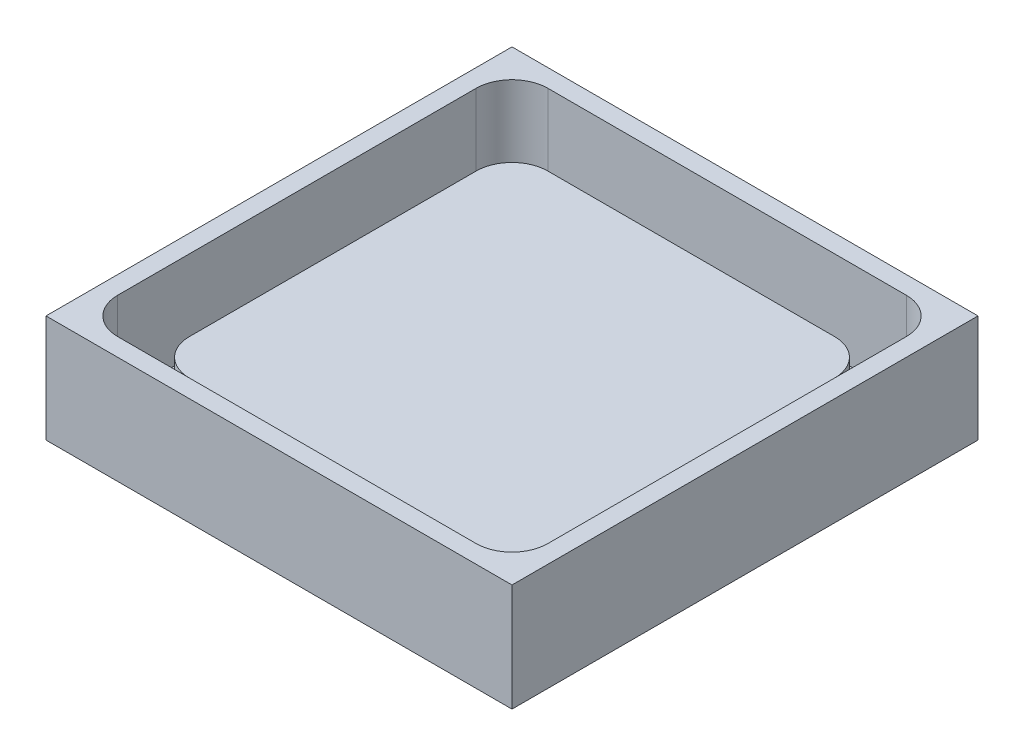
ISO-10303-21;
HEADER;
FILE_DESCRIPTION(('STEP AP214'),'2;1');
FILE_NAME('part.step','',(''),(''),'','','');
FILE_SCHEMA(('AUTOMOTIVE_DESIGN { 1 0 10303 214 1 1 1 1 }'));
ENDSEC;
DATA;
#1=APPLICATION_CONTEXT('core data for automotive mechanical design processes');
#2=APPLICATION_PROTOCOL_DEFINITION('international standard','automotive_design',2000,#1);
#3=PRODUCT_CONTEXT('',#1,'mechanical');
#4=PRODUCT('Part','Part','',(#3));
#5=PRODUCT_RELATED_PRODUCT_CATEGORY('part','',(#4));
#6=PRODUCT_DEFINITION_FORMATION('','',#4);
#7=PRODUCT_DEFINITION_CONTEXT('part definition',#1,'design');
#8=PRODUCT_DEFINITION('design','',#6,#7);
#9=PRODUCT_DEFINITION_SHAPE('','',#8);
#10=(LENGTH_UNIT() NAMED_UNIT(*) SI_UNIT(.MILLI.,.METRE.));
#11=(NAMED_UNIT(*) PLANE_ANGLE_UNIT() SI_UNIT($,.RADIAN.));
#12=(NAMED_UNIT(*) SI_UNIT($,.STERADIAN.) SOLID_ANGLE_UNIT());
#13=UNCERTAINTY_MEASURE_WITH_UNIT(LENGTH_MEASURE(1.E-05),#10,'distance_accuracy_value','');
#14=(GEOMETRIC_REPRESENTATION_CONTEXT(3) GLOBAL_UNCERTAINTY_ASSIGNED_CONTEXT((#13)) GLOBAL_UNIT_ASSIGNED_CONTEXT((#10,
#11,#12)) REPRESENTATION_CONTEXT('',''));
#15=CARTESIAN_POINT('',(0.,0.,0.));
#16=DIRECTION('',(0.,0.,1.));
#17=DIRECTION('',(1.,0.,0.));
#18=AXIS2_PLACEMENT_3D('',#15,#16,#17);
#19=CARTESIAN_POINT('',(10.,4.,10.));
#20=DIRECTION('',(-1.,0.,0.));
#21=DIRECTION('',(0.,0.,1.));
#22=AXIS2_PLACEMENT_3D('',#19,#20,#21);
#23=PLANE('',#22);
#24=DIRECTION('',(0.,0.,-1.));
#25=VECTOR('',#24,1.);
#26=CARTESIAN_POINT('',(10.,4.,10.));
#27=LINE('',#26,#25);
#28=CARTESIAN_POINT('',(10.,4.,8.));
#29=VERTEX_POINT('',#28);
#30=CARTESIAN_POINT('',(10.,4.,-8.));
#31=VERTEX_POINT('',#30);
#32=EDGE_CURVE('E226',#29,#31,#27,.T.);
#33=ORIENTED_EDGE('',*,*,#32,.F.);
#34=DIRECTION('',(0.,-1.,0.));
#35=VECTOR('',#34,1.);
#36=CARTESIAN_POINT('',(10.,4.,8.));
#37=LINE('',#36,#35);
#38=CARTESIAN_POINT('',(10.,1.,8.));
#39=VERTEX_POINT('',#38);
#40=EDGE_CURVE('E261',#29,#39,#37,.T.);
#41=ORIENTED_EDGE('',*,*,#40,.T.);
#42=DIRECTION('',(0.,0.,-1.));
#43=VECTOR('',#42,1.);
#44=CARTESIAN_POINT('',(10.,1.,10.));
#45=LINE('',#44,#43);
#46=CARTESIAN_POINT('',(10.,1.,-8.));
#47=VERTEX_POINT('',#46);
#48=EDGE_CURVE('E223',#39,#47,#45,.T.);
#49=ORIENTED_EDGE('',*,*,#48,.T.);
#50=DIRECTION('',(0.,-1.,0.));
#51=VECTOR('',#50,1.);
#52=CARTESIAN_POINT('',(10.,4.,-8.));
#53=LINE('',#52,#51);
#54=EDGE_CURVE('E259',#47,#31,#53,.F.);
#55=ORIENTED_EDGE('',*,*,#54,.T.);
#56=EDGE_LOOP('',(#33,#41,#49,#55));
#57=FACE_BOUND('',#56,.T.);
#58=ADVANCED_FACE('F39',(#57),#23,.F.);
#59=CARTESIAN_POINT('',(-10.,4.,-10.));
#60=DIRECTION('',(0.,0.,1.));
#61=DIRECTION('',(1.,0.,0.));
#62=AXIS2_PLACEMENT_3D('',#59,#60,#61);
#63=PLANE('',#62);
#64=DIRECTION('',(-1.,0.,0.));
#65=VECTOR('',#64,1.);
#66=CARTESIAN_POINT('',(-10.,4.,-10.));
#67=LINE('',#66,#65);
#68=CARTESIAN_POINT('',(8.,4.,-10.));
#69=VERTEX_POINT('',#68);
#70=CARTESIAN_POINT('',(-8.,4.,-10.));
#71=VERTEX_POINT('',#70);
#72=EDGE_CURVE('E229',#69,#71,#67,.T.);
#73=ORIENTED_EDGE('',*,*,#72,.F.);
#74=DIRECTION('',(0.,-1.,0.));
#75=VECTOR('',#74,1.);
#76=CARTESIAN_POINT('',(8.,4.,-10.));
#77=LINE('',#76,#75);
#78=CARTESIAN_POINT('',(8.,1.,-10.));
#79=VERTEX_POINT('',#78);
#80=EDGE_CURVE('E266',#69,#79,#77,.T.);
#81=ORIENTED_EDGE('',*,*,#80,.T.);
#82=DIRECTION('',(-1.,0.,0.));
#83=VECTOR('',#82,1.);
#84=CARTESIAN_POINT('',(-10.,1.,-10.));
#85=LINE('',#84,#83);
#86=CARTESIAN_POINT('',(-8.,1.,-10.));
#87=VERTEX_POINT('',#86);
#88=EDGE_CURVE('E220',#79,#87,#85,.T.);
#89=ORIENTED_EDGE('',*,*,#88,.T.);
#90=DIRECTION('',(0.,-1.,0.));
#91=VECTOR('',#90,1.);
#92=CARTESIAN_POINT('',(-8.,4.,-10.));
#93=LINE('',#92,#91);
#94=EDGE_CURVE('E264',#87,#71,#93,.F.);
#95=ORIENTED_EDGE('',*,*,#94,.T.);
#96=EDGE_LOOP('',(#73,#81,#89,#95));
#97=FACE_BOUND('',#96,.T.);
#98=ADVANCED_FACE('F380',(#97),#63,.F.);
#99=CARTESIAN_POINT('',(-10.,4.,10.));
#100=DIRECTION('',(1.,0.,0.));
#101=DIRECTION('',(0.,0.,-1.));
#102=AXIS2_PLACEMENT_3D('',#99,#100,#101);
#103=PLANE('',#102);
#104=DIRECTION('',(0.,0.,1.));
#105=VECTOR('',#104,1.);
#106=CARTESIAN_POINT('',(-10.,1.,10.));
#107=LINE('',#106,#105);
#108=CARTESIAN_POINT('',(-10.,1.,-8.));
#109=VERTEX_POINT('',#108);
#110=CARTESIAN_POINT('',(-10.,1.,8.));
#111=VERTEX_POINT('',#110);
#112=EDGE_CURVE('E217',#109,#111,#107,.T.);
#113=ORIENTED_EDGE('',*,*,#112,.T.);
#114=DIRECTION('',(0.,-1.,0.));
#115=VECTOR('',#114,1.);
#116=CARTESIAN_POINT('',(-10.,4.,8.));
#117=LINE('',#116,#115);
#118=CARTESIAN_POINT('',(-10.,4.,8.));
#119=VERTEX_POINT('',#118);
#120=EDGE_CURVE('E249',#111,#119,#117,.F.);
#121=ORIENTED_EDGE('',*,*,#120,.T.);
#122=DIRECTION('',(0.,0.,1.));
#123=VECTOR('',#122,1.);
#124=CARTESIAN_POINT('',(-10.,4.,10.));
#125=LINE('',#124,#123);
#126=CARTESIAN_POINT('',(-10.,4.,-8.));
#127=VERTEX_POINT('',#126);
#128=EDGE_CURVE('E232',#127,#119,#125,.T.);
#129=ORIENTED_EDGE('',*,*,#128,.F.);
#130=DIRECTION('',(0.,-1.,0.));
#131=VECTOR('',#130,1.);
#132=CARTESIAN_POINT('',(-10.,4.,-8.));
#133=LINE('',#132,#131);
#134=EDGE_CURVE('E246',#127,#109,#133,.T.);
#135=ORIENTED_EDGE('',*,*,#134,.T.);
#136=EDGE_LOOP('',(#113,#121,#129,#135));
#137=FACE_BOUND('',#136,.T.);
#138=ADVANCED_FACE('F387',(#137),#103,.F.);
#139=CARTESIAN_POINT('',(-10.,4.,10.));
#140=DIRECTION('',(0.,0.,-1.));
#141=DIRECTION('',(-1.,0.,0.));
#142=AXIS2_PLACEMENT_3D('',#139,#140,#141);
#143=PLANE('',#142);
#144=DIRECTION('',(1.,0.,0.));
#145=VECTOR('',#144,1.);
#146=CARTESIAN_POINT('',(-10.,4.,10.));
#147=LINE('',#146,#145);
#148=CARTESIAN_POINT('',(-8.,4.,10.));
#149=VERTEX_POINT('',#148);
#150=CARTESIAN_POINT('',(8.,4.,10.));
#151=VERTEX_POINT('',#150);
#152=EDGE_CURVE('E235',#149,#151,#147,.T.);
#153=ORIENTED_EDGE('',*,*,#152,.F.);
#154=DIRECTION('',(0.,-1.,0.));
#155=VECTOR('',#154,1.);
#156=CARTESIAN_POINT('',(-8.,4.,10.));
#157=LINE('',#156,#155);
#158=CARTESIAN_POINT('',(-8.,1.,10.));
#159=VERTEX_POINT('',#158);
#160=EDGE_CURVE('E243',#149,#159,#157,.T.);
#161=ORIENTED_EDGE('',*,*,#160,.T.);
#162=DIRECTION('',(1.,0.,0.));
#163=VECTOR('',#162,1.);
#164=CARTESIAN_POINT('',(-10.,1.,10.));
#165=LINE('',#164,#163);
#166=CARTESIAN_POINT('',(8.,1.,10.));
#167=VERTEX_POINT('',#166);
#168=EDGE_CURVE('E238',#159,#167,#165,.T.);
#169=ORIENTED_EDGE('',*,*,#168,.T.);
#170=DIRECTION('',(0.,-1.,0.));
#171=VECTOR('',#170,1.);
#172=CARTESIAN_POINT('',(8.,4.,10.));
#173=LINE('',#172,#171);
#174=EDGE_CURVE('E241',#167,#151,#173,.F.);
#175=ORIENTED_EDGE('',*,*,#174,.T.);
#176=EDGE_LOOP('',(#153,#161,#169,#175));
#177=FACE_BOUND('',#176,.T.);
#178=ADVANCED_FACE('F554',(#177),#143,.F.);
#179=CARTESIAN_POINT('',(0.,4.,0.));
#180=DIRECTION('',(0.,-1.,0.));
#181=DIRECTION('',(0.,0.,-1.));
#182=AXIS2_PLACEMENT_3D('',#179,#180,#181);
#183=PLANE('',#182);
#184=ORIENTED_EDGE('',*,*,#128,.T.);
#185=CARTESIAN_POINT('',(-8.,4.,8.));
#186=DIRECTION('',(0.,-1.,0.));
#187=DIRECTION('',(0.,0.,-1.));
#188=AXIS2_PLACEMENT_3D('',#185,#186,#187);
#189=CIRCLE('',#188,2.);
#190=EDGE_CURVE('E257',#119,#149,#189,.F.);
#191=ORIENTED_EDGE('',*,*,#190,.T.);
#192=ORIENTED_EDGE('',*,*,#152,.T.);
#193=CARTESIAN_POINT('',(8.,4.,8.));
#194=DIRECTION('',(0.,-1.,0.));
#195=DIRECTION('',(0.,0.,-1.));
#196=AXIS2_PLACEMENT_3D('',#193,#194,#195);
#197=CIRCLE('',#196,2.);
#198=EDGE_CURVE('E255',#151,#29,#197,.F.);
#199=ORIENTED_EDGE('',*,*,#198,.T.);
#200=ORIENTED_EDGE('',*,*,#32,.T.);
#201=CARTESIAN_POINT('',(8.,4.,-8.));
#202=DIRECTION('',(0.,-1.,0.));
#203=DIRECTION('',(0.,0.,-1.));
#204=AXIS2_PLACEMENT_3D('',#201,#202,#203);
#205=CIRCLE('',#204,2.);
#206=EDGE_CURVE('E253',#31,#69,#205,.F.);
#207=ORIENTED_EDGE('',*,*,#206,.T.);
#208=ORIENTED_EDGE('',*,*,#72,.T.);
#209=CARTESIAN_POINT('',(-8.,4.,-8.));
#210=DIRECTION('',(0.,-1.,0.));
#211=DIRECTION('',(0.,0.,-1.));
#212=AXIS2_PLACEMENT_3D('',#209,#210,#211);
#213=CIRCLE('',#212,2.);
#214=EDGE_CURVE('E251',#71,#127,#213,.F.);
#215=ORIENTED_EDGE('',*,*,#214,.T.);
#216=EDGE_LOOP('',(#184,#191,#192,#199,#200,#207,#208,#215));
#217=FACE_BOUND('',#216,.T.);
#218=ADVANCED_FACE('F540',(#217),#183,.F.);
#219=CARTESIAN_POINT('',(0.,1.,0.));
#220=DIRECTION('',(0.,1.,0.));
#221=DIRECTION('',(0.,0.,1.));
#222=AXIS2_PLACEMENT_3D('',#219,#220,#221);
#223=PLANE('',#222);
#224=DIRECTION('',(1.,0.,0.));
#225=VECTOR('',#224,1.);
#226=CARTESIAN_POINT('',(-12.,1.,12.));
#227=LINE('',#226,#225);
#228=CARTESIAN_POINT('',(-10.,1.,12.));
#229=VERTEX_POINT('',#228);
#230=CARTESIAN_POINT('',(10.,1.,12.));
#231=VERTEX_POINT('',#230);
#232=EDGE_CURVE('E211',#229,#231,#227,.T.);
#233=ORIENTED_EDGE('',*,*,#232,.T.);
#234=CARTESIAN_POINT('',(10.,1.,10.));
#235=DIRECTION('',(0.,1.,0.));
#236=DIRECTION('',(0.,0.,1.));
#237=AXIS2_PLACEMENT_3D('',#234,#235,#236);
#238=CIRCLE('',#237,2.);
#239=CARTESIAN_POINT('',(12.,1.,10.));
#240=VERTEX_POINT('',#239);
#241=EDGE_CURVE('E288',#231,#240,#238,.T.);
#242=ORIENTED_EDGE('',*,*,#241,.T.);
#243=DIRECTION('',(0.,0.,-1.));
#244=VECTOR('',#243,1.);
#245=CARTESIAN_POINT('',(12.,1.,12.));
#246=LINE('',#245,#244);
#247=CARTESIAN_POINT('',(12.,1.,-10.));
#248=VERTEX_POINT('',#247);
#249=EDGE_CURVE('E203',#240,#248,#246,.T.);
#250=ORIENTED_EDGE('',*,*,#249,.T.);
#251=CARTESIAN_POINT('',(10.,1.,-10.));
#252=DIRECTION('',(0.,1.,0.));
#253=DIRECTION('',(0.,0.,1.));
#254=AXIS2_PLACEMENT_3D('',#251,#252,#253);
#255=CIRCLE('',#254,2.);
#256=CARTESIAN_POINT('',(10.,1.,-12.));
#257=VERTEX_POINT('',#256);
#258=EDGE_CURVE('E284',#248,#257,#255,.T.);
#259=ORIENTED_EDGE('',*,*,#258,.T.);
#260=DIRECTION('',(1.,0.,0.));
#261=VECTOR('',#260,1.);
#262=CARTESIAN_POINT('',(-12.,1.,-12.));
#263=LINE('',#262,#261);
#264=CARTESIAN_POINT('',(-10.,1.,-12.));
#265=VERTEX_POINT('',#264);
#266=EDGE_CURVE('E201',#265,#257,#263,.T.);
#267=ORIENTED_EDGE('',*,*,#266,.F.);
#268=CARTESIAN_POINT('',(-10.,1.,-10.));
#269=DIRECTION('',(0.,1.,0.));
#270=DIRECTION('',(0.,0.,1.));
#271=AXIS2_PLACEMENT_3D('',#268,#269,#270);
#272=CIRCLE('',#271,2.);
#273=CARTESIAN_POINT('',(-12.,1.,-10.));
#274=VERTEX_POINT('',#273);
#275=EDGE_CURVE('E282',#265,#274,#272,.T.);
#276=ORIENTED_EDGE('',*,*,#275,.T.);
#277=DIRECTION('',(0.,0.,-1.));
#278=VECTOR('',#277,1.);
#279=CARTESIAN_POINT('',(-12.,1.,12.));
#280=LINE('',#279,#278);
#281=CARTESIAN_POINT('',(-12.,1.,10.));
#282=VERTEX_POINT('',#281);
#283=EDGE_CURVE('E214',#282,#274,#280,.T.);
#284=ORIENTED_EDGE('',*,*,#283,.F.);
#285=CARTESIAN_POINT('',(-10.,1.,10.));
#286=DIRECTION('',(0.,1.,0.));
#287=DIRECTION('',(0.,0.,1.));
#288=AXIS2_PLACEMENT_3D('',#285,#286,#287);
#289=CIRCLE('',#288,2.);
#290=EDGE_CURVE('E286',#282,#229,#289,.T.);
#291=ORIENTED_EDGE('',*,*,#290,.T.);
#292=EDGE_LOOP('',(#233,#242,#250,#259,#267,#276,#284,#291));
#293=FACE_BOUND('',#292,.T.);
#294=ORIENTED_EDGE('',*,*,#48,.F.);
#295=CARTESIAN_POINT('',(8.,1.,8.));
#296=DIRECTION('',(0.,1.,0.));
#297=DIRECTION('',(0.,0.,1.));
#298=AXIS2_PLACEMENT_3D('',#295,#296,#297);
#299=CIRCLE('',#298,2.);
#300=EDGE_CURVE('E271',#39,#167,#299,.F.);
#301=ORIENTED_EDGE('',*,*,#300,.T.);
#302=ORIENTED_EDGE('',*,*,#168,.F.);
#303=CARTESIAN_POINT('',(-8.,1.,8.));
#304=DIRECTION('',(0.,1.,0.));
#305=DIRECTION('',(0.,0.,1.));
#306=AXIS2_PLACEMENT_3D('',#303,#304,#305);
#307=CIRCLE('',#306,2.);
#308=EDGE_CURVE('E269',#159,#111,#307,.F.);
#309=ORIENTED_EDGE('',*,*,#308,.T.);
#310=ORIENTED_EDGE('',*,*,#112,.F.);
#311=CARTESIAN_POINT('',(-8.,1.,-8.));
#312=DIRECTION('',(0.,1.,0.));
#313=DIRECTION('',(0.,0.,1.));
#314=AXIS2_PLACEMENT_3D('',#311,#312,#313);
#315=CIRCLE('',#314,2.);
#316=EDGE_CURVE('E275',#109,#87,#315,.F.);
#317=ORIENTED_EDGE('',*,*,#316,.T.);
#318=ORIENTED_EDGE('',*,*,#88,.F.);
#319=CARTESIAN_POINT('',(8.,1.,-8.));
#320=DIRECTION('',(0.,1.,0.));
#321=DIRECTION('',(0.,0.,1.));
#322=AXIS2_PLACEMENT_3D('',#319,#320,#321);
#323=CIRCLE('',#322,2.);
#324=EDGE_CURVE('E273',#79,#47,#323,.F.);
#325=ORIENTED_EDGE('',*,*,#324,.T.);
#326=EDGE_LOOP('',(#294,#301,#302,#309,#310,#317,#318,#325));
#327=FACE_BOUND('',#326,.T.);
#328=ADVANCED_FACE('F323',(#293,#327),#223,.T.);
#329=CARTESIAN_POINT('',(0.,6.,0.));
#330=DIRECTION('',(0.,-1.,0.));
#331=DIRECTION('',(0.,0.,-1.));
#332=AXIS2_PLACEMENT_3D('',#329,#330,#331);
#333=PLANE('',#332);
#334=DIRECTION('',(0.,0.,-1.));
#335=VECTOR('',#334,1.);
#336=CARTESIAN_POINT('',(13.,6.,13.));
#337=LINE('',#336,#335);
#338=CARTESIAN_POINT('',(13.,6.,13.));
#339=VERTEX_POINT('',#338);
#340=CARTESIAN_POINT('',(13.,6.,-13.));
#341=VERTEX_POINT('',#340);
#342=EDGE_CURVE('E187',#339,#341,#337,.T.);
#343=ORIENTED_EDGE('',*,*,#342,.T.);
#344=DIRECTION('',(-1.,0.,0.));
#345=VECTOR('',#344,1.);
#346=CARTESIAN_POINT('',(-13.,6.,-13.));
#347=LINE('',#346,#345);
#348=CARTESIAN_POINT('',(-13.,6.,-13.));
#349=VERTEX_POINT('',#348);
#350=EDGE_CURVE('E176',#341,#349,#347,.T.);
#351=ORIENTED_EDGE('',*,*,#350,.T.);
#352=DIRECTION('',(0.,0.,1.));
#353=VECTOR('',#352,1.);
#354=CARTESIAN_POINT('',(-13.,6.,13.));
#355=LINE('',#354,#353);
#356=CARTESIAN_POINT('',(-13.,6.,13.));
#357=VERTEX_POINT('',#356);
#358=EDGE_CURVE('E186',#349,#357,#355,.T.);
#359=ORIENTED_EDGE('',*,*,#358,.T.);
#360=DIRECTION('',(1.,0.,0.));
#361=VECTOR('',#360,1.);
#362=CARTESIAN_POINT('',(-13.,6.,13.));
#363=LINE('',#362,#361);
#364=EDGE_CURVE('E192',#357,#339,#363,.T.);
#365=ORIENTED_EDGE('',*,*,#364,.T.);
#366=EDGE_LOOP('',(#343,#351,#359,#365));
#367=FACE_BOUND('',#366,.T.);
#368=DIRECTION('',(0.,0.,-1.));
#369=VECTOR('',#368,1.);
#370=CARTESIAN_POINT('',(12.,6.,12.));
#371=LINE('',#370,#369);
#372=CARTESIAN_POINT('',(12.,6.,10.));
#373=VERTEX_POINT('',#372);
#374=CARTESIAN_POINT('',(12.,6.,-10.));
#375=VERTEX_POINT('',#374);
#376=EDGE_CURVE('E310',#373,#375,#371,.T.);
#377=ORIENTED_EDGE('',*,*,#376,.F.);
#378=CARTESIAN_POINT('',(10.,6.,10.));
#379=DIRECTION('',(0.,-1.,0.));
#380=DIRECTION('',(0.,0.,-1.));
#381=AXIS2_PLACEMENT_3D('',#378,#379,#380);
#382=CIRCLE('',#381,2.);
#383=CARTESIAN_POINT('',(10.,6.,12.));
#384=VERTEX_POINT('',#383);
#385=EDGE_CURVE('E304',#373,#384,#382,.T.);
#386=ORIENTED_EDGE('',*,*,#385,.T.);
#387=DIRECTION('',(1.,0.,0.));
#388=VECTOR('',#387,1.);
#389=CARTESIAN_POINT('',(-12.,6.,12.));
#390=LINE('',#389,#388);
#391=CARTESIAN_POINT('',(-10.,6.,12.));
#392=VERTEX_POINT('',#391);
#393=EDGE_CURVE('E345',#392,#384,#390,.T.);
#394=ORIENTED_EDGE('',*,*,#393,.F.);
#395=CARTESIAN_POINT('',(-10.,6.,10.));
#396=DIRECTION('',(0.,-1.,0.));
#397=DIRECTION('',(0.,0.,-1.));
#398=AXIS2_PLACEMENT_3D('',#395,#396,#397);
#399=CIRCLE('',#398,2.);
#400=CARTESIAN_POINT('',(-12.,6.,10.));
#401=VERTEX_POINT('',#400);
#402=EDGE_CURVE('E306',#392,#401,#399,.T.);
#403=ORIENTED_EDGE('',*,*,#402,.T.);
#404=DIRECTION('',(0.,0.,1.));
#405=VECTOR('',#404,1.);
#406=CARTESIAN_POINT('',(-12.,6.,12.));
#407=LINE('',#406,#405);
#408=CARTESIAN_POINT('',(-12.,6.,-10.));
#409=VERTEX_POINT('',#408);
#410=EDGE_CURVE('E334',#409,#401,#407,.T.);
#411=ORIENTED_EDGE('',*,*,#410,.F.);
#412=CARTESIAN_POINT('',(-10.,6.,-10.));
#413=DIRECTION('',(0.,-1.,0.));
#414=DIRECTION('',(0.,0.,-1.));
#415=AXIS2_PLACEMENT_3D('',#412,#413,#414);
#416=CIRCLE('',#415,2.);
#417=CARTESIAN_POINT('',(-10.,6.,-12.));
#418=VERTEX_POINT('',#417);
#419=EDGE_CURVE('E11',#409,#418,#416,.T.);
#420=ORIENTED_EDGE('',*,*,#419,.T.);
#421=DIRECTION('',(-1.,0.,0.));
#422=VECTOR('',#421,1.);
#423=CARTESIAN_POINT('',(-12.,6.,-12.));
#424=LINE('',#423,#422);
#425=CARTESIAN_POINT('',(10.,6.,-12.));
#426=VERTEX_POINT('',#425);
#427=EDGE_CURVE('E312',#426,#418,#424,.T.);
#428=ORIENTED_EDGE('',*,*,#427,.F.);
#429=CARTESIAN_POINT('',(10.,6.,-10.));
#430=DIRECTION('',(0.,-1.,0.));
#431=DIRECTION('',(0.,0.,-1.));
#432=AXIS2_PLACEMENT_3D('',#429,#430,#431);
#433=CIRCLE('',#432,2.);
#434=EDGE_CURVE('E47',#426,#375,#433,.T.);
#435=ORIENTED_EDGE('',*,*,#434,.T.);
#436=EDGE_LOOP('',(#377,#386,#394,#403,#411,#420,#428,#435));
#437=FACE_BOUND('',#436,.T.);
#438=ADVANCED_FACE('F190',(#367,#437),#333,.F.);
#439=CARTESIAN_POINT('',(13.,6.,13.));
#440=DIRECTION('',(-1.,0.,0.));
#441=DIRECTION('',(0.,0.,1.));
#442=AXIS2_PLACEMENT_3D('',#439,#440,#441);
#443=PLANE('',#442);
#444=DIRECTION('',(0.,0.,-1.));
#445=VECTOR('',#444,1.);
#446=CARTESIAN_POINT('',(13.,0.,13.));
#447=LINE('',#446,#445);
#448=CARTESIAN_POINT('',(13.,0.,13.));
#449=VERTEX_POINT('',#448);
#450=CARTESIAN_POINT('',(13.,0.,-13.));
#451=VERTEX_POINT('',#450);
#452=EDGE_CURVE('E200',#449,#451,#447,.T.);
#453=ORIENTED_EDGE('',*,*,#452,.T.);
#454=DIRECTION('',(0.,-1.,0.));
#455=VECTOR('',#454,1.);
#456=CARTESIAN_POINT('',(13.,6.,-13.));
#457=LINE('',#456,#455);
#458=EDGE_CURVE('E180',#341,#451,#457,.T.);
#459=ORIENTED_EDGE('',*,*,#458,.F.);
#460=ORIENTED_EDGE('',*,*,#342,.F.);
#461=DIRECTION('',(0.,-1.,0.));
#462=VECTOR('',#461,1.);
#463=CARTESIAN_POINT('',(13.,6.,13.));
#464=LINE('',#463,#462);
#465=EDGE_CURVE('E355',#339,#449,#464,.T.);
#466=ORIENTED_EDGE('',*,*,#465,.T.);
#467=EDGE_LOOP('',(#453,#459,#460,#466));
#468=FACE_BOUND('',#467,.T.);
#469=ADVANCED_FACE('F198',(#468),#443,.F.);
#470=CARTESIAN_POINT('',(-13.,6.,-13.));
#471=DIRECTION('',(0.,0.,1.));
#472=DIRECTION('',(1.,0.,0.));
#473=AXIS2_PLACEMENT_3D('',#470,#471,#472);
#474=PLANE('',#473);
#475=DIRECTION('',(-1.,0.,0.));
#476=VECTOR('',#475,1.);
#477=CARTESIAN_POINT('',(-13.,0.,-13.));
#478=LINE('',#477,#476);
#479=CARTESIAN_POINT('',(-13.,0.,-13.));
#480=VERTEX_POINT('',#479);
#481=EDGE_CURVE('E349',#451,#480,#478,.T.);
#482=ORIENTED_EDGE('',*,*,#481,.T.);
#483=DIRECTION('',(0.,-1.,0.));
#484=VECTOR('',#483,1.);
#485=CARTESIAN_POINT('',(-13.,6.,-13.));
#486=LINE('',#485,#484);
#487=EDGE_CURVE('E183',#349,#480,#486,.T.);
#488=ORIENTED_EDGE('',*,*,#487,.F.);
#489=ORIENTED_EDGE('',*,*,#350,.F.);
#490=ORIENTED_EDGE('',*,*,#458,.T.);
#491=EDGE_LOOP('',(#482,#488,#489,#490));
#492=FACE_BOUND('',#491,.T.);
#493=ADVANCED_FACE('F178',(#492),#474,.F.);
#494=CARTESIAN_POINT('',(-13.,6.,13.));
#495=DIRECTION('',(1.,0.,0.));
#496=DIRECTION('',(0.,0.,-1.));
#497=AXIS2_PLACEMENT_3D('',#494,#495,#496);
#498=PLANE('',#497);
#499=DIRECTION('',(0.,0.,1.));
#500=VECTOR('',#499,1.);
#501=CARTESIAN_POINT('',(-13.,0.,13.));
#502=LINE('',#501,#500);
#503=CARTESIAN_POINT('',(-13.,0.,13.));
#504=VERTEX_POINT('',#503);
#505=EDGE_CURVE('E358',#480,#504,#502,.T.);
#506=ORIENTED_EDGE('',*,*,#505,.T.);
#507=DIRECTION('',(0.,-1.,0.));
#508=VECTOR('',#507,1.);
#509=CARTESIAN_POINT('',(-13.,6.,13.));
#510=LINE('',#509,#508);
#511=EDGE_CURVE('E205',#357,#504,#510,.T.);
#512=ORIENTED_EDGE('',*,*,#511,.F.);
#513=ORIENTED_EDGE('',*,*,#358,.F.);
#514=ORIENTED_EDGE('',*,*,#487,.T.);
#515=EDGE_LOOP('',(#506,#512,#513,#514));
#516=FACE_BOUND('',#515,.T.);
#517=ADVANCED_FACE('F370',(#516),#498,.F.);
#518=CARTESIAN_POINT('',(-13.,6.,13.));
#519=DIRECTION('',(0.,0.,-1.));
#520=DIRECTION('',(-1.,0.,0.));
#521=AXIS2_PLACEMENT_3D('',#518,#519,#520);
#522=PLANE('',#521);
#523=DIRECTION('',(1.,0.,0.));
#524=VECTOR('',#523,1.);
#525=CARTESIAN_POINT('',(-13.,0.,13.));
#526=LINE('',#525,#524);
#527=EDGE_CURVE('E196',#504,#449,#526,.T.);
#528=ORIENTED_EDGE('',*,*,#527,.T.);
#529=ORIENTED_EDGE('',*,*,#465,.F.);
#530=ORIENTED_EDGE('',*,*,#364,.F.);
#531=ORIENTED_EDGE('',*,*,#511,.T.);
#532=EDGE_LOOP('',(#528,#529,#530,#531));
#533=FACE_BOUND('',#532,.T.);
#534=ADVANCED_FACE('F365',(#533),#522,.F.);
#535=CARTESIAN_POINT('',(12.,6.,12.));
#536=DIRECTION('',(-1.,0.,0.));
#537=DIRECTION('',(0.,0.,1.));
#538=AXIS2_PLACEMENT_3D('',#535,#536,#537);
#539=PLANE('',#538);
#540=ORIENTED_EDGE('',*,*,#249,.F.);
#541=DIRECTION('',(0.,-1.,0.));
#542=VECTOR('',#541,1.);
#543=CARTESIAN_POINT('',(12.,6.,10.));
#544=LINE('',#543,#542);
#545=EDGE_CURVE('E293',#240,#373,#544,.F.);
#546=ORIENTED_EDGE('',*,*,#545,.T.);
#547=ORIENTED_EDGE('',*,*,#376,.T.);
#548=DIRECTION('',(0.,-1.,0.));
#549=VECTOR('',#548,1.);
#550=CARTESIAN_POINT('',(12.,1.,-10.));
#551=LINE('',#550,#549);
#552=EDGE_CURVE('E290',#375,#248,#551,.T.);
#553=ORIENTED_EDGE('',*,*,#552,.T.);
#554=EDGE_LOOP('',(#540,#546,#547,#553));
#555=FACE_BOUND('',#554,.T.);
#556=ADVANCED_FACE('F317',(#555),#539,.T.);
#557=CARTESIAN_POINT('',(-12.,6.,-12.));
#558=DIRECTION('',(0.,0.,1.));
#559=DIRECTION('',(1.,0.,0.));
#560=AXIS2_PLACEMENT_3D('',#557,#558,#559);
#561=PLANE('',#560);
#562=ORIENTED_EDGE('',*,*,#266,.T.);
#563=DIRECTION('',(0.,-1.,0.));
#564=VECTOR('',#563,1.);
#565=CARTESIAN_POINT('',(10.,6.,-12.));
#566=LINE('',#565,#564);
#567=EDGE_CURVE('E59',#257,#426,#566,.F.);
#568=ORIENTED_EDGE('',*,*,#567,.T.);
#569=ORIENTED_EDGE('',*,*,#427,.T.);
#570=DIRECTION('',(0.,-1.,0.));
#571=VECTOR('',#570,1.);
#572=CARTESIAN_POINT('',(-10.,1.,-12.));
#573=LINE('',#572,#571);
#574=EDGE_CURVE('E300',#418,#265,#573,.T.);
#575=ORIENTED_EDGE('',*,*,#574,.T.);
#576=EDGE_LOOP('',(#562,#568,#569,#575));
#577=FACE_BOUND('',#576,.T.);
#578=ADVANCED_FACE('F325',(#577),#561,.T.);
#579=CARTESIAN_POINT('',(-12.,6.,12.));
#580=DIRECTION('',(1.,0.,0.));
#581=DIRECTION('',(0.,0.,-1.));
#582=AXIS2_PLACEMENT_3D('',#579,#580,#581);
#583=PLANE('',#582);
#584=ORIENTED_EDGE('',*,*,#410,.T.);
#585=DIRECTION('',(0.,-1.,0.));
#586=VECTOR('',#585,1.);
#587=CARTESIAN_POINT('',(-12.,1.,10.));
#588=LINE('',#587,#586);
#589=EDGE_CURVE('E297',#401,#282,#588,.T.);
#590=ORIENTED_EDGE('',*,*,#589,.T.);
#591=ORIENTED_EDGE('',*,*,#283,.T.);
#592=DIRECTION('',(0.,-1.,0.));
#593=VECTOR('',#592,1.);
#594=CARTESIAN_POINT('',(-12.,6.,-10.));
#595=LINE('',#594,#593);
#596=EDGE_CURVE('E295',#274,#409,#595,.F.);
#597=ORIENTED_EDGE('',*,*,#596,.T.);
#598=EDGE_LOOP('',(#584,#590,#591,#597));
#599=FACE_BOUND('',#598,.T.);
#600=ADVANCED_FACE('F332',(#599),#583,.T.);
#601=CARTESIAN_POINT('',(-12.,6.,12.));
#602=DIRECTION('',(0.,0.,-1.));
#603=DIRECTION('',(-1.,0.,0.));
#604=AXIS2_PLACEMENT_3D('',#601,#602,#603);
#605=PLANE('',#604);
#606=ORIENTED_EDGE('',*,*,#393,.T.);
#607=DIRECTION('',(0.,-1.,0.));
#608=VECTOR('',#607,1.);
#609=CARTESIAN_POINT('',(10.,1.,12.));
#610=LINE('',#609,#608);
#611=EDGE_CURVE('E279',#384,#231,#610,.T.);
#612=ORIENTED_EDGE('',*,*,#611,.T.);
#613=ORIENTED_EDGE('',*,*,#232,.F.);
#614=DIRECTION('',(0.,-1.,0.));
#615=VECTOR('',#614,1.);
#616=CARTESIAN_POINT('',(-10.,6.,12.));
#617=LINE('',#616,#615);
#618=EDGE_CURVE('E277',#229,#392,#617,.F.);
#619=ORIENTED_EDGE('',*,*,#618,.T.);
#620=EDGE_LOOP('',(#606,#612,#613,#619));
#621=FACE_BOUND('',#620,.T.);
#622=ADVANCED_FACE('F342',(#621),#605,.T.);
#623=CARTESIAN_POINT('',(0.,0.,0.));
#624=DIRECTION('',(0.,-1.,0.));
#625=DIRECTION('',(0.,0.,-1.));
#626=AXIS2_PLACEMENT_3D('',#623,#624,#625);
#627=PLANE('',#626);
#628=ORIENTED_EDGE('',*,*,#452,.F.);
#629=ORIENTED_EDGE('',*,*,#527,.F.);
#630=ORIENTED_EDGE('',*,*,#505,.F.);
#631=ORIENTED_EDGE('',*,*,#481,.F.);
#632=EDGE_LOOP('',(#628,#629,#630,#631));
#633=FACE_BOUND('',#632,.T.);
#634=ADVANCED_FACE('F369',(#633),#627,.T.);
#635=CARTESIAN_POINT('',(-8.,4.,8.));
#636=DIRECTION('',(0.,-1.,0.));
#637=DIRECTION('',(0.,0.,-1.));
#638=AXIS2_PLACEMENT_3D('',#635,#636,#637);
#639=CYLINDRICAL_SURFACE('',#638,2.);
#640=ORIENTED_EDGE('',*,*,#190,.F.);
#641=ORIENTED_EDGE('',*,*,#120,.F.);
#642=ORIENTED_EDGE('',*,*,#308,.F.);
#643=ORIENTED_EDGE('',*,*,#160,.F.);
#644=EDGE_LOOP('',(#640,#641,#642,#643));
#645=FACE_BOUND('',#644,.T.);
#646=ADVANCED_FACE('F393',(#645),#639,.T.);
#647=CARTESIAN_POINT('',(8.,4.,8.));
#648=DIRECTION('',(0.,-1.,0.));
#649=DIRECTION('',(0.,0.,-1.));
#650=AXIS2_PLACEMENT_3D('',#647,#648,#649);
#651=CYLINDRICAL_SURFACE('',#650,2.);
#652=ORIENTED_EDGE('',*,*,#198,.F.);
#653=ORIENTED_EDGE('',*,*,#174,.F.);
#654=ORIENTED_EDGE('',*,*,#300,.F.);
#655=ORIENTED_EDGE('',*,*,#40,.F.);
#656=EDGE_LOOP('',(#652,#653,#654,#655));
#657=FACE_BOUND('',#656,.T.);
#658=ADVANCED_FACE('F396',(#657),#651,.T.);
#659=CARTESIAN_POINT('',(8.,4.,-8.));
#660=DIRECTION('',(0.,-1.,0.));
#661=DIRECTION('',(0.,0.,-1.));
#662=AXIS2_PLACEMENT_3D('',#659,#660,#661);
#663=CYLINDRICAL_SURFACE('',#662,2.);
#664=ORIENTED_EDGE('',*,*,#206,.F.);
#665=ORIENTED_EDGE('',*,*,#54,.F.);
#666=ORIENTED_EDGE('',*,*,#324,.F.);
#667=ORIENTED_EDGE('',*,*,#80,.F.);
#668=EDGE_LOOP('',(#664,#665,#666,#667));
#669=FACE_BOUND('',#668,.T.);
#670=ADVANCED_FACE('F400',(#669),#663,.T.);
#671=CARTESIAN_POINT('',(-8.,4.,-8.));
#672=DIRECTION('',(0.,-1.,0.));
#673=DIRECTION('',(0.,0.,-1.));
#674=AXIS2_PLACEMENT_3D('',#671,#672,#673);
#675=CYLINDRICAL_SURFACE('',#674,2.);
#676=ORIENTED_EDGE('',*,*,#214,.F.);
#677=ORIENTED_EDGE('',*,*,#94,.F.);
#678=ORIENTED_EDGE('',*,*,#316,.F.);
#679=ORIENTED_EDGE('',*,*,#134,.F.);
#680=EDGE_LOOP('',(#676,#677,#678,#679));
#681=FACE_BOUND('',#680,.T.);
#682=ADVANCED_FACE('F404',(#681),#675,.T.);
#683=CARTESIAN_POINT('',(10.,6.,10.));
#684=DIRECTION('',(0.,1.,0.));
#685=DIRECTION('',(0.,0.,1.));
#686=AXIS2_PLACEMENT_3D('',#683,#684,#685);
#687=CYLINDRICAL_SURFACE('',#686,2.);
#688=ORIENTED_EDGE('',*,*,#385,.F.);
#689=ORIENTED_EDGE('',*,*,#545,.F.);
#690=ORIENTED_EDGE('',*,*,#241,.F.);
#691=ORIENTED_EDGE('',*,*,#611,.F.);
#692=EDGE_LOOP('',(#688,#689,#690,#691));
#693=FACE_BOUND('',#692,.T.);
#694=ADVANCED_FACE('F347',(#693),#687,.F.);
#695=CARTESIAN_POINT('',(-10.,6.,10.));
#696=DIRECTION('',(0.,1.,0.));
#697=DIRECTION('',(0.,0.,1.));
#698=AXIS2_PLACEMENT_3D('',#695,#696,#697);
#699=CYLINDRICAL_SURFACE('',#698,2.);
#700=ORIENTED_EDGE('',*,*,#402,.F.);
#701=ORIENTED_EDGE('',*,*,#618,.F.);
#702=ORIENTED_EDGE('',*,*,#290,.F.);
#703=ORIENTED_EDGE('',*,*,#589,.F.);
#704=EDGE_LOOP('',(#700,#701,#702,#703));
#705=FACE_BOUND('',#704,.T.);
#706=ADVANCED_FACE('F337',(#705),#699,.F.);
#707=CARTESIAN_POINT('',(10.,6.,-10.));
#708=DIRECTION('',(0.,1.,0.));
#709=DIRECTION('',(0.,0.,1.));
#710=AXIS2_PLACEMENT_3D('',#707,#708,#709);
#711=CYLINDRICAL_SURFACE('',#710,2.);
#712=ORIENTED_EDGE('',*,*,#434,.F.);
#713=ORIENTED_EDGE('',*,*,#567,.F.);
#714=ORIENTED_EDGE('',*,*,#258,.F.);
#715=ORIENTED_EDGE('',*,*,#552,.F.);
#716=EDGE_LOOP('',(#712,#713,#714,#715));
#717=FACE_BOUND('',#716,.T.);
#718=ADVANCED_FACE('F320',(#717),#711,.F.);
#719=CARTESIAN_POINT('',(-10.,6.,-10.));
#720=DIRECTION('',(0.,1.,0.));
#721=DIRECTION('',(0.,0.,1.));
#722=AXIS2_PLACEMENT_3D('',#719,#720,#721);
#723=CYLINDRICAL_SURFACE('',#722,2.);
#724=ORIENTED_EDGE('',*,*,#419,.F.);
#725=ORIENTED_EDGE('',*,*,#596,.F.);
#726=ORIENTED_EDGE('',*,*,#275,.F.);
#727=ORIENTED_EDGE('',*,*,#574,.F.);
#728=EDGE_LOOP('',(#724,#725,#726,#727));
#729=FACE_BOUND('',#728,.T.);
#730=ADVANCED_FACE('F41',(#729),#723,.F.);
#731=CLOSED_SHELL('',(#58,#98,#138,#178,#218,#328,#438,#469,#493,#517,#534,#556,#578,#600,#622,
#634,#646,#658,#670,#682,#694,#706,#718,#730));
#732=MANIFOLD_SOLID_BREP('B2',#731);
#733=ADVANCED_BREP_SHAPE_REPRESENTATION('',(#18,#732),#14);
#734=SHAPE_DEFINITION_REPRESENTATION(#9,#733);
ENDSEC;
END-ISO-10303-21;
